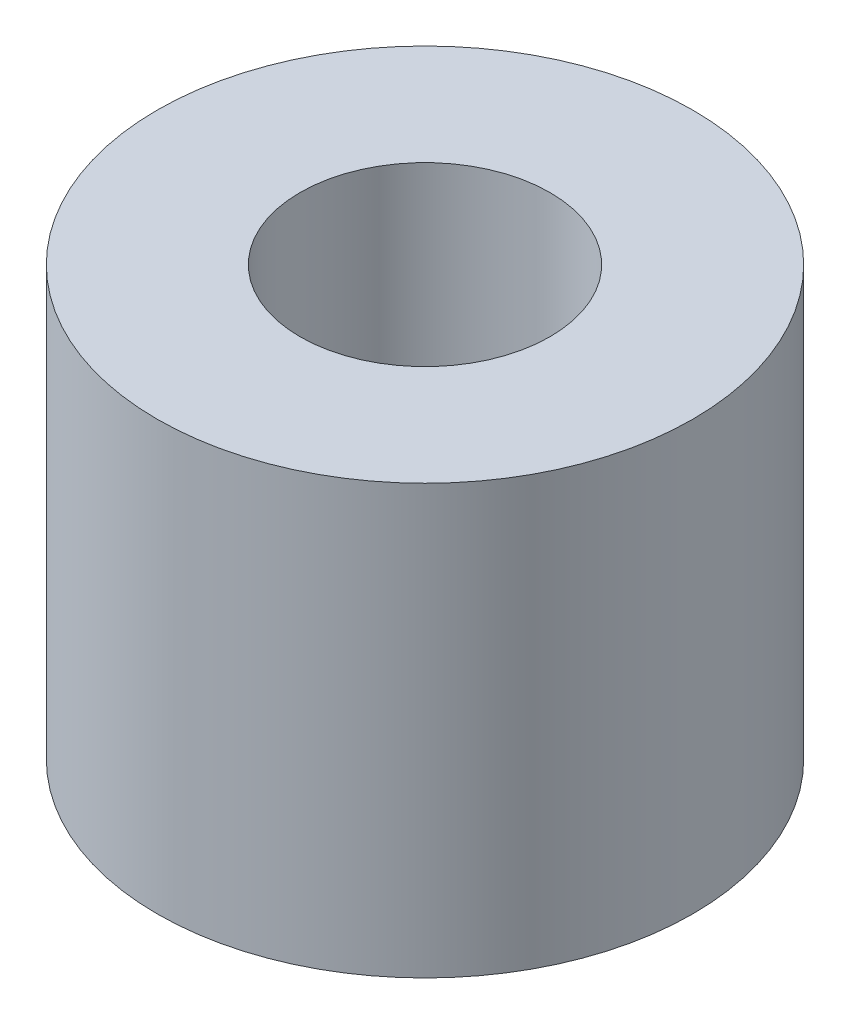
ISO-10303-21;
HEADER;
FILE_DESCRIPTION(('STEP AP214'),'2;1');
FILE_NAME('part.step','',(''),(''),'','','');
FILE_SCHEMA(('AUTOMOTIVE_DESIGN { 1 0 10303 214 1 1 1 1 }'));
ENDSEC;
DATA;
#1=APPLICATION_CONTEXT('core data for automotive mechanical design processes');
#2=APPLICATION_PROTOCOL_DEFINITION('international standard','automotive_design',2000,#1);
#3=PRODUCT_CONTEXT('',#1,'mechanical');
#4=PRODUCT('Part','Part','',(#3));
#5=PRODUCT_RELATED_PRODUCT_CATEGORY('part','',(#4));
#6=PRODUCT_DEFINITION_FORMATION('','',#4);
#7=PRODUCT_DEFINITION_CONTEXT('part definition',#1,'design');
#8=PRODUCT_DEFINITION('design','',#6,#7);
#9=PRODUCT_DEFINITION_SHAPE('','',#8);
#10=(LENGTH_UNIT() NAMED_UNIT(*) SI_UNIT(.MILLI.,.METRE.));
#11=(NAMED_UNIT(*) PLANE_ANGLE_UNIT() SI_UNIT($,.RADIAN.));
#12=(NAMED_UNIT(*) SI_UNIT($,.STERADIAN.) SOLID_ANGLE_UNIT());
#13=UNCERTAINTY_MEASURE_WITH_UNIT(LENGTH_MEASURE(1.E-05),#10,'distance_accuracy_value','');
#14=(GEOMETRIC_REPRESENTATION_CONTEXT(3) GLOBAL_UNCERTAINTY_ASSIGNED_CONTEXT((#13)) GLOBAL_UNIT_ASSIGNED_CONTEXT((#10,
#11,#12)) REPRESENTATION_CONTEXT('',''));
#15=CARTESIAN_POINT('',(0.,0.,0.));
#16=DIRECTION('',(0.,0.,1.));
#17=DIRECTION('',(1.,0.,0.));
#18=AXIS2_PLACEMENT_3D('',#15,#16,#17);
#19=CARTESIAN_POINT('',(0.,6.,0.));
#20=DIRECTION('',(0.,1.,0.));
#21=DIRECTION('',(0.,0.,1.));
#22=AXIS2_PLACEMENT_3D('',#19,#20,#21);
#23=PLANE('',#22);
#24=CARTESIAN_POINT('',(0.,6.,0.));
#25=DIRECTION('',(0.,1.,0.));
#26=DIRECTION('',(0.,0.,1.));
#27=AXIS2_PLACEMENT_3D('',#24,#25,#26);
#28=CIRCLE('',#27,3.75);
#29=CARTESIAN_POINT('',(0.,6.,3.75));
#30=VERTEX_POINT('',#29);
#31=EDGE_CURVE('E10',#30,#30,#28,.T.);
#32=ORIENTED_EDGE('',*,*,#31,.T.);
#33=EDGE_LOOP('',(#32));
#34=FACE_BOUND('',#33,.T.);
#35=CARTESIAN_POINT('',(0.,6.,0.));
#36=DIRECTION('',(0.,1.,0.));
#37=DIRECTION('',(0.,0.,1.));
#38=AXIS2_PLACEMENT_3D('',#35,#36,#37);
#39=CIRCLE('',#38,1.75);
#40=CARTESIAN_POINT('',(0.,6.,1.75));
#41=VERTEX_POINT('',#40);
#42=EDGE_CURVE('E41',#41,#41,#39,.T.);
#43=ORIENTED_EDGE('',*,*,#42,.F.);
#44=EDGE_LOOP('',(#43));
#45=FACE_BOUND('',#44,.T.);
#46=ADVANCED_FACE('F30',(#34,#45),#23,.T.);
#47=CARTESIAN_POINT('',(0.,0.,0.));
#48=DIRECTION('',(0.,1.,0.));
#49=DIRECTION('',(0.,0.,1.));
#50=AXIS2_PLACEMENT_3D('',#47,#48,#49);
#51=PLANE('',#50);
#52=CARTESIAN_POINT('',(0.,0.,0.));
#53=DIRECTION('',(0.,1.,0.));
#54=DIRECTION('',(0.,0.,1.));
#55=AXIS2_PLACEMENT_3D('',#52,#53,#54);
#56=CIRCLE('',#55,3.75);
#57=CARTESIAN_POINT('',(0.,0.,3.75));
#58=VERTEX_POINT('',#57);
#59=EDGE_CURVE('E34',#58,#58,#56,.T.);
#60=ORIENTED_EDGE('',*,*,#59,.F.);
#61=EDGE_LOOP('',(#60));
#62=FACE_BOUND('',#61,.T.);
#63=CARTESIAN_POINT('',(0.,0.,0.));
#64=DIRECTION('',(0.,1.,0.));
#65=DIRECTION('',(0.,0.,1.));
#66=AXIS2_PLACEMENT_3D('',#63,#64,#65);
#67=CIRCLE('',#66,1.75);
#68=CARTESIAN_POINT('',(0.,0.,1.75));
#69=VERTEX_POINT('',#68);
#70=EDGE_CURVE('E43',#69,#69,#67,.T.);
#71=ORIENTED_EDGE('',*,*,#70,.T.);
#72=EDGE_LOOP('',(#71));
#73=FACE_BOUND('',#72,.T.);
#74=ADVANCED_FACE('F53',(#62,#73),#51,.F.);
#75=CARTESIAN_POINT('',(0.,6.,0.));
#76=DIRECTION('',(0.,-1.,0.));
#77=DIRECTION('',(0.,0.,-1.));
#78=AXIS2_PLACEMENT_3D('',#75,#76,#77);
#79=CYLINDRICAL_SURFACE('',#78,3.75);
#80=ORIENTED_EDGE('',*,*,#31,.F.);
#81=EDGE_LOOP('',(#80));
#82=FACE_BOUND('',#81,.T.);
#83=ORIENTED_EDGE('',*,*,#59,.T.);
#84=EDGE_LOOP('',(#83));
#85=FACE_BOUND('',#84,.T.);
#86=ADVANCED_FACE('F32',(#82,#85),#79,.T.);
#87=CARTESIAN_POINT('',(0.,6.,0.));
#88=DIRECTION('',(0.,-1.,0.));
#89=DIRECTION('',(0.,0.,-1.));
#90=AXIS2_PLACEMENT_3D('',#87,#88,#89);
#91=CYLINDRICAL_SURFACE('',#90,1.75);
#92=ORIENTED_EDGE('',*,*,#42,.T.);
#93=EDGE_LOOP('',(#92));
#94=FACE_BOUND('',#93,.T.);
#95=ORIENTED_EDGE('',*,*,#70,.F.);
#96=EDGE_LOOP('',(#95));
#97=FACE_BOUND('',#96,.T.);
#98=ADVANCED_FACE('F49',(#94,#97),#91,.F.);
#99=CLOSED_SHELL('',(#46,#74,#86,#98));
#100=MANIFOLD_SOLID_BREP('B2',#99);
#101=ADVANCED_BREP_SHAPE_REPRESENTATION('',(#18,#100),#14);
#102=SHAPE_DEFINITION_REPRESENTATION(#9,#101);
ENDSEC;
END-ISO-10303-21;
